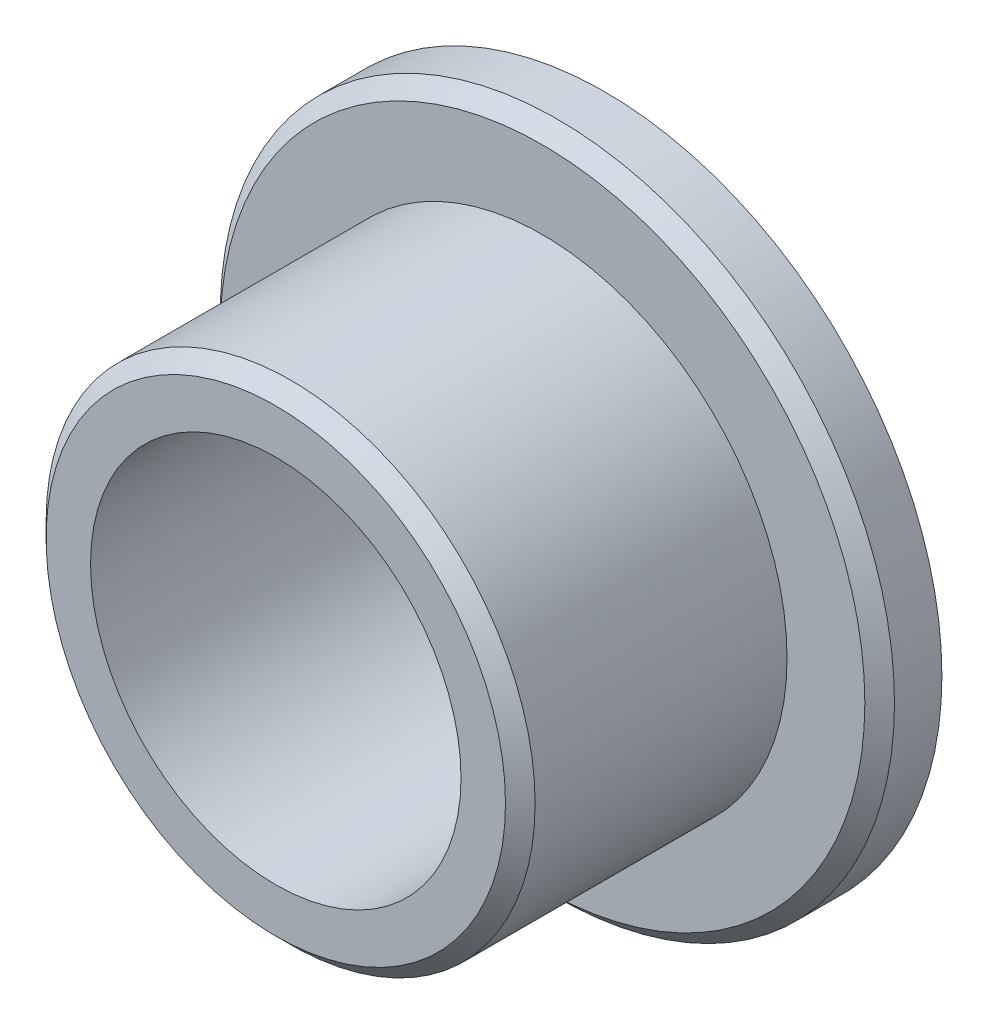
ISO-10303-21;
HEADER;
FILE_DESCRIPTION(('STEP AP214'),'2;1');
FILE_NAME('part.step','',(''),(''),'','','');
FILE_SCHEMA(('AUTOMOTIVE_DESIGN { 1 0 10303 214 1 1 1 1 }'));
ENDSEC;
DATA;
#1=APPLICATION_CONTEXT('core data for automotive mechanical design processes');
#2=APPLICATION_PROTOCOL_DEFINITION('international standard','automotive_design',2000,#1);
#3=PRODUCT_CONTEXT('',#1,'mechanical');
#4=PRODUCT('Part','Part','',(#3));
#5=PRODUCT_RELATED_PRODUCT_CATEGORY('part','',(#4));
#6=PRODUCT_DEFINITION_FORMATION('','',#4);
#7=PRODUCT_DEFINITION_CONTEXT('part definition',#1,'design');
#8=PRODUCT_DEFINITION('design','',#6,#7);
#9=PRODUCT_DEFINITION_SHAPE('','',#8);
#10=(LENGTH_UNIT() NAMED_UNIT(*) SI_UNIT(.MILLI.,.METRE.));
#11=(NAMED_UNIT(*) PLANE_ANGLE_UNIT() SI_UNIT($,.RADIAN.));
#12=(NAMED_UNIT(*) SI_UNIT($,.STERADIAN.) SOLID_ANGLE_UNIT());
#13=UNCERTAINTY_MEASURE_WITH_UNIT(LENGTH_MEASURE(1.E-05),#10,'distance_accuracy_value','');
#14=(GEOMETRIC_REPRESENTATION_CONTEXT(3) GLOBAL_UNCERTAINTY_ASSIGNED_CONTEXT((#13)) GLOBAL_UNIT_ASSIGNED_CONTEXT((#10,
#11,#12)) REPRESENTATION_CONTEXT('',''));
#15=CARTESIAN_POINT('',(0.,0.,0.));
#16=DIRECTION('',(0.,0.,1.));
#17=DIRECTION('',(1.,0.,0.));
#18=AXIS2_PLACEMENT_3D('',#15,#16,#17);
#19=CARTESIAN_POINT('',(0.,0.,4.2));
#20=DIRECTION('',(0.,0.,-1.));
#21=DIRECTION('',(-1.,0.,0.));
#22=AXIS2_PLACEMENT_3D('',#19,#20,#21);
#23=CYLINDRICAL_SURFACE('',#22,22.75);
#24=CARTESIAN_POINT('',(0.,0.,3.19999999999998));
#25=DIRECTION('',(0.,0.,1.));
#26=DIRECTION('',(1.,0.,0.));
#27=AXIS2_PLACEMENT_3D('',#24,#25,#26);
#28=CIRCLE('',#27,22.75);
#29=CARTESIAN_POINT('',(22.75,0.,3.19999999999998));
#30=VERTEX_POINT('',#29);
#31=EDGE_CURVE('E50',#30,#30,#28,.F.);
#32=ORIENTED_EDGE('',*,*,#31,.T.);
#33=EDGE_LOOP('',(#32));
#34=FACE_BOUND('',#33,.T.);
#35=CARTESIAN_POINT('',(0.,0.,0.));
#36=DIRECTION('',(0.,0.,1.));
#37=DIRECTION('',(1.,0.,0.));
#38=AXIS2_PLACEMENT_3D('',#35,#36,#37);
#39=CIRCLE('',#38,22.75);
#40=CARTESIAN_POINT('',(22.75,0.,0.));
#41=VERTEX_POINT('',#40);
#42=EDGE_CURVE('E62',#41,#41,#39,.T.);
#43=ORIENTED_EDGE('',*,*,#42,.T.);
#44=EDGE_LOOP('',(#43));
#45=FACE_BOUND('',#44,.T.);
#46=ADVANCED_FACE('F37',(#34,#45),#23,.T.);
#47=CARTESIAN_POINT('',(0.,0.,4.2));
#48=DIRECTION('',(0.,0.,1.));
#49=DIRECTION('',(1.,0.,0.));
#50=AXIS2_PLACEMENT_3D('',#47,#48,#49);
#51=PLANE('',#50);
#52=CARTESIAN_POINT('',(0.,0.,4.2));
#53=DIRECTION('',(0.,0.,1.));
#54=DIRECTION('',(1.,0.,0.));
#55=AXIS2_PLACEMENT_3D('',#52,#53,#54);
#56=CIRCLE('',#55,21.75);
#57=CARTESIAN_POINT('',(21.75,0.,4.2));
#58=VERTEX_POINT('',#57);
#59=EDGE_CURVE('E55',#58,#58,#56,.T.);
#60=ORIENTED_EDGE('',*,*,#59,.T.);
#61=EDGE_LOOP('',(#60));
#62=FACE_BOUND('',#61,.T.);
#63=CARTESIAN_POINT('',(0.,0.,4.2));
#64=DIRECTION('',(0.,0.,1.));
#65=DIRECTION('',(1.,0.,0.));
#66=AXIS2_PLACEMENT_3D('',#63,#64,#65);
#67=CIRCLE('',#66,16.5);
#68=CARTESIAN_POINT('',(16.5,0.,4.2));
#69=VERTEX_POINT('',#68);
#70=EDGE_CURVE('E61',#69,#69,#67,.T.);
#71=ORIENTED_EDGE('',*,*,#70,.F.);
#72=EDGE_LOOP('',(#71));
#73=FACE_BOUND('',#72,.T.);
#74=ADVANCED_FACE('F97',(#62,#73),#51,.T.);
#75=CARTESIAN_POINT('',(0.,0.,0.));
#76=DIRECTION('',(0.,0.,1.));
#77=DIRECTION('',(1.,0.,0.));
#78=AXIS2_PLACEMENT_3D('',#75,#76,#77);
#79=PLANE('',#78);
#80=CARTESIAN_POINT('',(0.,0.,0.));
#81=DIRECTION('',(0.,0.,1.));
#82=DIRECTION('',(1.,0.,0.));
#83=AXIS2_PLACEMENT_3D('',#80,#81,#82);
#84=CIRCLE('',#83,12.5);
#85=CARTESIAN_POINT('',(12.5,0.,0.));
#86=VERTEX_POINT('',#85);
#87=EDGE_CURVE('E66',#86,#86,#84,.T.);
#88=ORIENTED_EDGE('',*,*,#87,.T.);
#89=EDGE_LOOP('',(#88));
#90=FACE_BOUND('',#89,.T.);
#91=ORIENTED_EDGE('',*,*,#42,.F.);
#92=EDGE_LOOP('',(#91));
#93=FACE_BOUND('',#92,.T.);
#94=ADVANCED_FACE('F78',(#90,#93),#79,.F.);
#95=CARTESIAN_POINT('',(0.,0.,22.2));
#96=DIRECTION('',(0.,0.,-1.));
#97=DIRECTION('',(-1.,0.,0.));
#98=AXIS2_PLACEMENT_3D('',#95,#96,#97);
#99=CYLINDRICAL_SURFACE('',#98,16.5);
#100=CARTESIAN_POINT('',(0.,0.,21.2));
#101=DIRECTION('',(0.,0.,1.));
#102=DIRECTION('',(1.,0.,0.));
#103=AXIS2_PLACEMENT_3D('',#100,#101,#102);
#104=CIRCLE('',#103,16.5);
#105=CARTESIAN_POINT('',(16.5,0.,21.2));
#106=VERTEX_POINT('',#105);
#107=EDGE_CURVE('E10',#106,#106,#104,.F.);
#108=ORIENTED_EDGE('',*,*,#107,.T.);
#109=EDGE_LOOP('',(#108));
#110=FACE_BOUND('',#109,.T.);
#111=ORIENTED_EDGE('',*,*,#70,.T.);
#112=EDGE_LOOP('',(#111));
#113=FACE_BOUND('',#112,.T.);
#114=ADVANCED_FACE('F90',(#110,#113),#99,.T.);
#115=CARTESIAN_POINT('',(0.,0.,22.2));
#116=DIRECTION('',(0.,0.,1.));
#117=DIRECTION('',(1.,0.,0.));
#118=AXIS2_PLACEMENT_3D('',#115,#116,#117);
#119=PLANE('',#118);
#120=CARTESIAN_POINT('',(0.,0.,22.2));
#121=DIRECTION('',(0.,0.,1.));
#122=DIRECTION('',(1.,0.,0.));
#123=AXIS2_PLACEMENT_3D('',#120,#121,#122);
#124=CIRCLE('',#123,15.5);
#125=CARTESIAN_POINT('',(15.5,0.,22.2));
#126=VERTEX_POINT('',#125);
#127=EDGE_CURVE('E45',#126,#126,#124,.T.);
#128=ORIENTED_EDGE('',*,*,#127,.T.);
#129=EDGE_LOOP('',(#128));
#130=FACE_BOUND('',#129,.T.);
#131=CARTESIAN_POINT('',(0.,0.,22.2));
#132=DIRECTION('',(0.,0.,1.));
#133=DIRECTION('',(1.,0.,0.));
#134=AXIS2_PLACEMENT_3D('',#131,#132,#133);
#135=CIRCLE('',#134,12.5);
#136=CARTESIAN_POINT('',(12.5,0.,22.2));
#137=VERTEX_POINT('',#136);
#138=EDGE_CURVE('E70',#137,#137,#135,.T.);
#139=ORIENTED_EDGE('',*,*,#138,.F.);
#140=EDGE_LOOP('',(#139));
#141=FACE_BOUND('',#140,.T.);
#142=ADVANCED_FACE('F85',(#130,#141),#119,.T.);
#143=CARTESIAN_POINT('',(0.,0.,0.));
#144=DIRECTION('',(0.,0.,1.));
#145=DIRECTION('',(1.,0.,0.));
#146=AXIS2_PLACEMENT_3D('',#143,#144,#145);
#147=CYLINDRICAL_SURFACE('',#146,12.5);
#148=ORIENTED_EDGE('',*,*,#87,.F.);
#149=EDGE_LOOP('',(#148));
#150=FACE_BOUND('',#149,.T.);
#151=ORIENTED_EDGE('',*,*,#138,.T.);
#152=EDGE_LOOP('',(#151));
#153=FACE_BOUND('',#152,.T.);
#154=ADVANCED_FACE('F81',(#150,#153),#147,.F.);
#155=CARTESIAN_POINT('',(0.,0.,4.2));
#156=DIRECTION('',(0.,0.,-1.));
#157=DIRECTION('',(-1.,0.,0.));
#158=AXIS2_PLACEMENT_3D('',#155,#156,#157);
#159=CONICAL_SURFACE('',#158,21.75,0.78539816339744);
#160=ORIENTED_EDGE('',*,*,#31,.F.);
#161=EDGE_LOOP('',(#160));
#162=FACE_BOUND('',#161,.T.);
#163=ORIENTED_EDGE('',*,*,#59,.F.);
#164=EDGE_LOOP('',(#163));
#165=FACE_BOUND('',#164,.T.);
#166=ADVANCED_FACE('F84',(#162,#165),#159,.T.);
#167=CARTESIAN_POINT('',(0.,0.,22.2));
#168=DIRECTION('',(0.,0.,-1.));
#169=DIRECTION('',(-1.,0.,0.));
#170=AXIS2_PLACEMENT_3D('',#167,#168,#169);
#171=CONICAL_SURFACE('',#170,15.5,0.785398163397445);
#172=ORIENTED_EDGE('',*,*,#107,.F.);
#173=EDGE_LOOP('',(#172));
#174=FACE_BOUND('',#173,.T.);
#175=ORIENTED_EDGE('',*,*,#127,.F.);
#176=EDGE_LOOP('',(#175));
#177=FACE_BOUND('',#176,.T.);
#178=ADVANCED_FACE('F39',(#174,#177),#171,.T.);
#179=CLOSED_SHELL('',(#46,#74,#94,#114,#142,#154,#166,#178));
#180=MANIFOLD_SOLID_BREP('B2',#179);
#181=ADVANCED_BREP_SHAPE_REPRESENTATION('',(#18,#180),#14);
#182=SHAPE_DEFINITION_REPRESENTATION(#9,#181);
ENDSEC;
END-ISO-10303-21;
